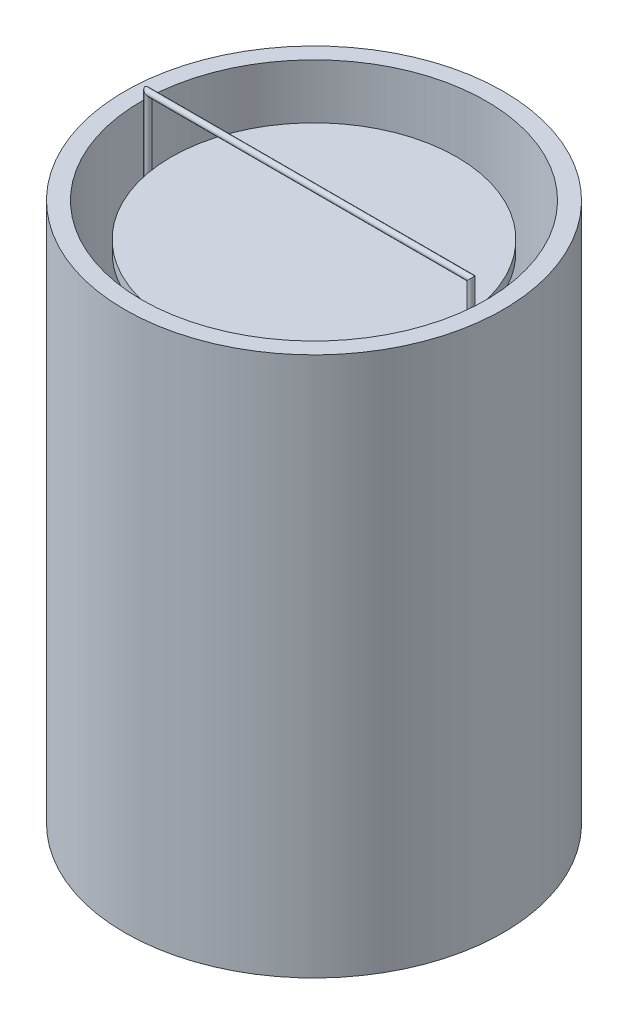
ISO-10303-21;
HEADER;
FILE_DESCRIPTION(('STEP AP214'),'2;1');
FILE_NAME('part.step','',(''),(''),'','','');
FILE_SCHEMA(('AUTOMOTIVE_DESIGN { 1 0 10303 214 1 1 1 1 }'));
ENDSEC;
DATA;
#1=APPLICATION_CONTEXT('core data for automotive mechanical design processes');
#2=APPLICATION_PROTOCOL_DEFINITION('international standard','automotive_design',2000,#1);
#3=PRODUCT_CONTEXT('',#1,'mechanical');
#4=PRODUCT('Part','Part','',(#3));
#5=PRODUCT_RELATED_PRODUCT_CATEGORY('part','',(#4));
#6=PRODUCT_DEFINITION_FORMATION('','',#4);
#7=PRODUCT_DEFINITION_CONTEXT('part definition',#1,'design');
#8=PRODUCT_DEFINITION('design','',#6,#7);
#9=PRODUCT_DEFINITION_SHAPE('','',#8);
#10=(LENGTH_UNIT() NAMED_UNIT(*) SI_UNIT(.MILLI.,.METRE.));
#11=(NAMED_UNIT(*) PLANE_ANGLE_UNIT() SI_UNIT($,.RADIAN.));
#12=(NAMED_UNIT(*) SI_UNIT($,.STERADIAN.) SOLID_ANGLE_UNIT());
#13=UNCERTAINTY_MEASURE_WITH_UNIT(LENGTH_MEASURE(1.E-05),#10,'distance_accuracy_value','');
#14=(GEOMETRIC_REPRESENTATION_CONTEXT(3) GLOBAL_UNCERTAINTY_ASSIGNED_CONTEXT((#13)) GLOBAL_UNIT_ASSIGNED_CONTEXT((#10,
#11,#12)) REPRESENTATION_CONTEXT('',''));
#15=CARTESIAN_POINT('',(0.,0.,0.));
#16=DIRECTION('',(0.,0.,1.));
#17=DIRECTION('',(1.,0.,0.));
#18=AXIS2_PLACEMENT_3D('',#15,#16,#17);
#19=CARTESIAN_POINT('',(63.5750589911287,222.175717615178,1.80350605197359));
#20=DIRECTION('',(1.,0.,0.));
#21=DIRECTION('',(0.,0.,-1.));
#22=AXIS2_PLACEMENT_3D('',#19,#20,#21);
#23=PLANE('',#22);
#24=CARTESIAN_POINT('',(63.5750589911287,222.175717615178,1.80350605197359));
#25=DIRECTION('',(1.,0.,0.));
#26=DIRECTION('',(0.,0.,-1.));
#27=AXIS2_PLACEMENT_3D('',#24,#25,#26);
#28=CIRCLE('',#27,1.325);
#29=CARTESIAN_POINT('',(63.5750589911287,222.175717615178,0.478506051973597));
#30=VERTEX_POINT('',#29);
#31=EDGE_CURVE('E49',#30,#30,#28,.T.);
#32=ORIENTED_EDGE('',*,*,#31,.F.);
#33=EDGE_LOOP('',(#32));
#34=FACE_BOUND('',#33,.T.);
#35=ADVANCED_FACE('F46',(#34),#23,.F.);
#36=CARTESIAN_POINT('',(-63.4743835410829,167.301815481761,1.80350605197474));
#37=DIRECTION('',(1.,0.,0.));
#38=DIRECTION('',(0.,0.,-1.));
#39=AXIS2_PLACEMENT_3D('',#36,#37,#38);
#40=PLANE('',#39);
#41=CARTESIAN_POINT('',(-63.4743835410829,167.301815481761,1.80350605197474));
#42=DIRECTION('',(1.,0.,0.));
#43=DIRECTION('',(0.,0.,-1.));
#44=AXIS2_PLACEMENT_3D('',#41,#42,#43);
#45=CIRCLE('',#44,1.325);
#46=CARTESIAN_POINT('',(-63.4743835410829,167.301815481761,0.478506051974744));
#47=VERTEX_POINT('',#46);
#48=EDGE_CURVE('E53',#47,#47,#45,.T.);
#49=ORIENTED_EDGE('',*,*,#48,.T.);
#50=EDGE_LOOP('',(#49));
#51=FACE_BOUND('',#50,.T.);
#52=ADVANCED_FACE('F75',(#51),#40,.T.);
#53=CARTESIAN_POINT('',(74.6570026492969,222.175717615178,1.80350605197352));
#54=DIRECTION('',(-1.,0.,0.));
#55=DIRECTION('',(0.,0.,1.));
#56=AXIS2_PLACEMENT_3D('',#53,#54,#55);
#57=CYLINDRICAL_SURFACE('',#56,1.325);
#58=CARTESIAN_POINT('',(71.6420026492969,222.175717615178,1.80350605197448));
#59=DIRECTION('',(-0.707106781186547,-0.707106781186547,0.));
#60=DIRECTION('',(0.707106781186548,-0.707106781186548,0.));
#61=AXIS2_PLACEMENT_3D('',#58,#59,#60);
#62=ELLIPSE('',#61,1.87383297014434,1.325);
#63=CARTESIAN_POINT('',(72.9670026492969,220.850717615178,1.80350605197447));
#64=VERTEX_POINT('',#63);
#65=EDGE_CURVE('E65',#64,#64,#62,.T.);
#66=ORIENTED_EDGE('',*,*,#65,.T.);
#67=EDGE_LOOP('',(#66));
#68=FACE_BOUND('',#67,.T.);
#69=ORIENTED_EDGE('',*,*,#31,.T.);
#70=EDGE_LOOP('',(#69));
#71=FACE_BOUND('',#70,.T.);
#72=ADVANCED_FACE('F72',(#68,#71),#57,.T.);
#73=CARTESIAN_POINT('',(71.6420026492969,249.764743448999,1.80350605197442));
#74=DIRECTION('',(0.,-1.,0.));
#75=DIRECTION('',(0.,0.,-1.));
#76=AXIS2_PLACEMENT_3D('',#73,#74,#75);
#77=CYLINDRICAL_SURFACE('',#76,1.325);
#78=CARTESIAN_POINT('',(71.6420026492968,246.749743448999,1.80350605197443));
#79=DIRECTION('',(0.707106781186547,-0.707106781186547,0.));
#80=DIRECTION('',(0.707106781186548,0.707106781186548,0.));
#81=AXIS2_PLACEMENT_3D('',#78,#79,#80);
#82=ELLIPSE('',#81,1.87383297014435,1.325);
#83=CARTESIAN_POINT('',(72.9670026492968,248.074743448999,1.80350605197442));
#84=VERTEX_POINT('',#83);
#85=EDGE_CURVE('E63',#84,#84,#82,.T.);
#86=ORIENTED_EDGE('',*,*,#85,.T.);
#87=EDGE_LOOP('',(#86));
#88=FACE_BOUND('',#87,.T.);
#89=ORIENTED_EDGE('',*,*,#65,.F.);
#90=EDGE_LOOP('',(#89));
#91=FACE_BOUND('',#90,.T.);
#92=ADVANCED_FACE('F95',(#88,#91),#77,.T.);
#93=CARTESIAN_POINT('',(-75.0603045278118,246.749743448999,1.80350605197455));
#94=DIRECTION('',(1.,0.,0.));
#95=DIRECTION('',(0.,0.,-1.));
#96=AXIS2_PLACEMENT_3D('',#93,#94,#95);
#97=CYLINDRICAL_SURFACE('',#96,1.325);
#98=CARTESIAN_POINT('',(-72.0453045278119,246.749743449,1.80350605197455));
#99=DIRECTION('',(0.707106781186547,0.707106781186547,0.));
#100=DIRECTION('',(-0.707106781186548,0.707106781186548,0.));
#101=AXIS2_PLACEMENT_3D('',#98,#99,#100);
#102=ELLIPSE('',#101,1.87383297014434,1.325);
#103=CARTESIAN_POINT('',(-73.3703045278119,248.074743449,1.80350605197455));
#104=VERTEX_POINT('',#103);
#105=EDGE_CURVE('E58',#104,#104,#102,.T.);
#106=ORIENTED_EDGE('',*,*,#105,.T.);
#107=EDGE_LOOP('',(#106));
#108=FACE_BOUND('',#107,.T.);
#109=ORIENTED_EDGE('',*,*,#85,.F.);
#110=EDGE_LOOP('',(#109));
#111=FACE_BOUND('',#110,.T.);
#112=ADVANCED_FACE('F88',(#108,#111),#97,.T.);
#113=CARTESIAN_POINT('',(-72.0453045278119,164.286815481761,1.80350605197469));
#114=DIRECTION('',(0.,1.,0.));
#115=DIRECTION('',(0.,0.,1.));
#116=AXIS2_PLACEMENT_3D('',#113,#114,#115);
#117=CYLINDRICAL_SURFACE('',#116,1.325);
#118=CARTESIAN_POINT('',(-72.0453045278119,167.301815481761,1.80350605197468));
#119=DIRECTION('',(-0.707106781186547,0.707106781186547,0.));
#120=DIRECTION('',(-0.707106781186548,-0.707106781186548,0.));
#121=AXIS2_PLACEMENT_3D('',#118,#119,#120);
#122=ELLIPSE('',#121,1.87383297014434,1.325);
#123=CARTESIAN_POINT('',(-73.3703045278119,165.976815481761,1.80350605197468));
#124=VERTEX_POINT('',#123);
#125=EDGE_CURVE('E11',#124,#124,#122,.T.);
#126=ORIENTED_EDGE('',*,*,#125,.T.);
#127=EDGE_LOOP('',(#126));
#128=FACE_BOUND('',#127,.T.);
#129=ORIENTED_EDGE('',*,*,#105,.F.);
#130=EDGE_LOOP('',(#129));
#131=FACE_BOUND('',#130,.T.);
#132=ADVANCED_FACE('F82',(#128,#131),#117,.T.);
#133=CARTESIAN_POINT('',(-63.4743835410829,167.301815481761,1.80350605197474));
#134=DIRECTION('',(-1.,0.,0.));
#135=DIRECTION('',(0.,0.,1.));
#136=AXIS2_PLACEMENT_3D('',#133,#134,#135);
#137=CYLINDRICAL_SURFACE('',#136,1.325);
#138=ORIENTED_EDGE('',*,*,#48,.F.);
#139=EDGE_LOOP('',(#138));
#140=FACE_BOUND('',#139,.T.);
#141=ORIENTED_EDGE('',*,*,#125,.F.);
#142=EDGE_LOOP('',(#141));
#143=FACE_BOUND('',#142,.T.);
#144=ADVANCED_FACE('F80',(#140,#143),#137,.T.);
#145=CLOSED_SHELL('',(#35,#52,#72,#92,#112,#132,#144));
#146=MANIFOLD_SOLID_BREP('B2',#145);
#147=CARTESIAN_POINT('',(0.,225.,0.));
#148=DIRECTION('',(0.,-1.,0.));
#149=DIRECTION('',(0.,0.,-1.));
#150=AXIS2_PLACEMENT_3D('',#147,#148,#149);
#151=CYLINDRICAL_SURFACE('',#150,63.5);
#152=CARTESIAN_POINT('',(0.,225.,0.));
#153=DIRECTION('',(0.,-1.,0.));
#154=DIRECTION('',(0.,0.,-1.));
#155=AXIS2_PLACEMENT_3D('',#152,#153,#154);
#156=CIRCLE('',#155,63.5);
#157=CARTESIAN_POINT('',(0.,225.,-63.5));
#158=VERTEX_POINT('',#157);
#159=EDGE_CURVE('E45',#158,#158,#156,.T.);
#160=ORIENTED_EDGE('',*,*,#159,.T.);
#161=EDGE_LOOP('',(#160));
#162=FACE_BOUND('',#161,.T.);
#163=CARTESIAN_POINT('',(0.,220.,0.));
#164=DIRECTION('',(0.,-1.,0.));
#165=DIRECTION('',(0.,0.,-1.));
#166=AXIS2_PLACEMENT_3D('',#163,#164,#165);
#167=CIRCLE('',#166,63.5);
#168=CARTESIAN_POINT('',(0.,220.,-63.5));
#169=VERTEX_POINT('',#168);
#170=EDGE_CURVE('E158',#169,#169,#167,.T.);
#171=ORIENTED_EDGE('',*,*,#170,.F.);
#172=EDGE_LOOP('',(#171));
#173=FACE_BOUND('',#172,.T.);
#174=ADVANCED_FACE('F155',(#162,#173),#151,.T.);
#175=CARTESIAN_POINT('',(0.,225.,0.));
#176=DIRECTION('',(0.,-1.,0.));
#177=DIRECTION('',(0.,0.,-1.));
#178=AXIS2_PLACEMENT_3D('',#175,#176,#177);
#179=PLANE('',#178);
#180=ORIENTED_EDGE('',*,*,#159,.F.);
#181=EDGE_LOOP('',(#180));
#182=FACE_BOUND('',#181,.T.);
#183=ADVANCED_FACE('F170',(#182),#179,.F.);
#184=CARTESIAN_POINT('',(0.,220.,0.));
#185=DIRECTION('',(0.,-1.,0.));
#186=DIRECTION('',(0.,0.,-1.));
#187=AXIS2_PLACEMENT_3D('',#184,#185,#186);
#188=PLANE('',#187);
#189=ORIENTED_EDGE('',*,*,#170,.T.);
#190=EDGE_LOOP('',(#189));
#191=FACE_BOUND('',#190,.T.);
#192=ADVANCED_FACE('F167',(#191),#188,.T.);
#193=CLOSED_SHELL('',(#174,#183,#192));
#194=MANIFOLD_SOLID_BREP('B6',#193);
#195=CARTESIAN_POINT('',(0.,170.,0.));
#196=DIRECTION('',(0.,-1.,0.));
#197=DIRECTION('',(0.,0.,-1.));
#198=AXIS2_PLACEMENT_3D('',#195,#196,#197);
#199=CYLINDRICAL_SURFACE('',#198,63.5);
#200=CARTESIAN_POINT('',(0.,170.,0.));
#201=DIRECTION('',(0.,-1.,0.));
#202=DIRECTION('',(0.,0.,-1.));
#203=AXIS2_PLACEMENT_3D('',#200,#201,#202);
#204=CIRCLE('',#203,63.5);
#205=CARTESIAN_POINT('',(0.,170.,-63.5));
#206=VERTEX_POINT('',#205);
#207=EDGE_CURVE('E154',#206,#206,#204,.T.);
#208=ORIENTED_EDGE('',*,*,#207,.T.);
#209=EDGE_LOOP('',(#208));
#210=FACE_BOUND('',#209,.T.);
#211=CARTESIAN_POINT('',(0.,165.,0.));
#212=DIRECTION('',(0.,-1.,0.));
#213=DIRECTION('',(0.,0.,-1.));
#214=AXIS2_PLACEMENT_3D('',#211,#212,#213);
#215=CIRCLE('',#214,63.5);
#216=CARTESIAN_POINT('',(0.,165.,-63.5));
#217=VERTEX_POINT('',#216);
#218=EDGE_CURVE('E207',#217,#217,#215,.T.);
#219=ORIENTED_EDGE('',*,*,#218,.F.);
#220=EDGE_LOOP('',(#219));
#221=FACE_BOUND('',#220,.T.);
#222=ADVANCED_FACE('F204',(#210,#221),#199,.T.);
#223=CARTESIAN_POINT('',(0.,170.,0.));
#224=DIRECTION('',(0.,-1.,0.));
#225=DIRECTION('',(0.,0.,-1.));
#226=AXIS2_PLACEMENT_3D('',#223,#224,#225);
#227=PLANE('',#226);
#228=ORIENTED_EDGE('',*,*,#207,.F.);
#229=EDGE_LOOP('',(#228));
#230=FACE_BOUND('',#229,.T.);
#231=ADVANCED_FACE('F219',(#230),#227,.F.);
#232=CARTESIAN_POINT('',(0.,165.,0.));
#233=DIRECTION('',(0.,-1.,0.));
#234=DIRECTION('',(0.,0.,-1.));
#235=AXIS2_PLACEMENT_3D('',#232,#233,#234);
#236=PLANE('',#235);
#237=ORIENTED_EDGE('',*,*,#218,.T.);
#238=EDGE_LOOP('',(#237));
#239=FACE_BOUND('',#238,.T.);
#240=ADVANCED_FACE('F216',(#239),#236,.T.);
#241=CLOSED_SHELL('',(#222,#231,#240));
#242=MANIFOLD_SOLID_BREP('B40',#241);
#243=CARTESIAN_POINT('',(0.,20.,0.));
#244=DIRECTION('',(0.,-1.,0.));
#245=DIRECTION('',(0.,0.,-1.));
#246=AXIS2_PLACEMENT_3D('',#243,#244,#245);
#247=CYLINDRICAL_SURFACE('',#246,76.5937);
#248=CARTESIAN_POINT('',(0.,20.,0.));
#249=DIRECTION('',(0.,-1.,0.));
#250=DIRECTION('',(0.,0.,-1.));
#251=AXIS2_PLACEMENT_3D('',#248,#249,#250);
#252=CIRCLE('',#251,76.5937);
#253=CARTESIAN_POINT('',(0.,20.,-76.5937));
#254=VERTEX_POINT('',#253);
#255=EDGE_CURVE('E203',#254,#254,#252,.T.);
#256=ORIENTED_EDGE('',*,*,#255,.T.);
#257=EDGE_LOOP('',(#256));
#258=FACE_BOUND('',#257,.T.);
#259=CARTESIAN_POINT('',(0.,0.,0.));
#260=DIRECTION('',(0.,-1.,0.));
#261=DIRECTION('',(0.,0.,-1.));
#262=AXIS2_PLACEMENT_3D('',#259,#260,#261);
#263=CIRCLE('',#262,76.5937);
#264=CARTESIAN_POINT('',(0.,0.,-76.5937));
#265=VERTEX_POINT('',#264);
#266=EDGE_CURVE('E255',#265,#265,#263,.T.);
#267=ORIENTED_EDGE('',*,*,#266,.F.);
#268=EDGE_LOOP('',(#267));
#269=FACE_BOUND('',#268,.T.);
#270=ADVANCED_FACE('F252',(#258,#269),#247,.T.);
#271=CARTESIAN_POINT('',(0.,20.,0.));
#272=DIRECTION('',(0.,-1.,0.));
#273=DIRECTION('',(0.,0.,-1.));
#274=AXIS2_PLACEMENT_3D('',#271,#272,#273);
#275=PLANE('',#274);
#276=ORIENTED_EDGE('',*,*,#255,.F.);
#277=EDGE_LOOP('',(#276));
#278=FACE_BOUND('',#277,.T.);
#279=ADVANCED_FACE('F267',(#278),#275,.F.);
#280=CARTESIAN_POINT('',(0.,0.,0.));
#281=DIRECTION('',(0.,-1.,0.));
#282=DIRECTION('',(0.,0.,-1.));
#283=AXIS2_PLACEMENT_3D('',#280,#281,#282);
#284=PLANE('',#283);
#285=ORIENTED_EDGE('',*,*,#266,.T.);
#286=EDGE_LOOP('',(#285));
#287=FACE_BOUND('',#286,.T.);
#288=ADVANCED_FACE('F264',(#287),#284,.T.);
#289=CLOSED_SHELL('',(#270,#279,#288));
#290=MANIFOLD_SOLID_BREP('B149',#289);
#291=CARTESIAN_POINT('',(0.,240.,0.));
#292=DIRECTION('',(0.,1.,0.));
#293=DIRECTION('',(0.,0.,1.));
#294=AXIS2_PLACEMENT_3D('',#291,#292,#293);
#295=PLANE('',#294);
#296=CARTESIAN_POINT('',(0.,240.,0.));
#297=DIRECTION('',(0.,1.,0.));
#298=DIRECTION('',(0.,0.,1.));
#299=AXIS2_PLACEMENT_3D('',#296,#297,#298);
#300=CIRCLE('',#299,84.1375);
#301=CARTESIAN_POINT('',(0.,240.,84.1375));
#302=VERTEX_POINT('',#301);
#303=EDGE_CURVE('E251',#302,#302,#300,.T.);
#304=ORIENTED_EDGE('',*,*,#303,.T.);
#305=EDGE_LOOP('',(#304));
#306=FACE_BOUND('',#305,.T.);
#307=CARTESIAN_POINT('',(0.,240.,0.));
#308=DIRECTION('',(0.,1.,0.));
#309=DIRECTION('',(0.,0.,1.));
#310=AXIS2_PLACEMENT_3D('',#307,#308,#309);
#311=CIRCLE('',#310,76.5937);
#312=CARTESIAN_POINT('',(0.,240.,76.5937));
#313=VERTEX_POINT('',#312);
#314=EDGE_CURVE('E304',#313,#313,#311,.T.);
#315=ORIENTED_EDGE('',*,*,#314,.F.);
#316=EDGE_LOOP('',(#315));
#317=FACE_BOUND('',#316,.T.);
#318=ADVANCED_FACE('F293',(#306,#317),#295,.T.);
#319=CARTESIAN_POINT('',(0.,0.,0.));
#320=DIRECTION('',(0.,1.,0.));
#321=DIRECTION('',(0.,0.,1.));
#322=AXIS2_PLACEMENT_3D('',#319,#320,#321);
#323=PLANE('',#322);
#324=CARTESIAN_POINT('',(0.,0.,0.));
#325=DIRECTION('',(0.,1.,0.));
#326=DIRECTION('',(0.,0.,1.));
#327=AXIS2_PLACEMENT_3D('',#324,#325,#326);
#328=CIRCLE('',#327,84.1375);
#329=CARTESIAN_POINT('',(0.,0.,84.1375));
#330=VERTEX_POINT('',#329);
#331=EDGE_CURVE('E297',#330,#330,#328,.T.);
#332=ORIENTED_EDGE('',*,*,#331,.F.);
#333=EDGE_LOOP('',(#332));
#334=FACE_BOUND('',#333,.T.);
#335=CARTESIAN_POINT('',(0.,0.,0.));
#336=DIRECTION('',(0.,1.,0.));
#337=DIRECTION('',(0.,0.,1.));
#338=AXIS2_PLACEMENT_3D('',#335,#336,#337);
#339=CIRCLE('',#338,76.5937);
#340=CARTESIAN_POINT('',(0.,0.,76.5937));
#341=VERTEX_POINT('',#340);
#342=EDGE_CURVE('E306',#341,#341,#339,.T.);
#343=ORIENTED_EDGE('',*,*,#342,.T.);
#344=EDGE_LOOP('',(#343));
#345=FACE_BOUND('',#344,.T.);
#346=ADVANCED_FACE('F316',(#334,#345),#323,.F.);
#347=CARTESIAN_POINT('',(0.,240.,0.));
#348=DIRECTION('',(0.,-1.,0.));
#349=DIRECTION('',(0.,0.,-1.));
#350=AXIS2_PLACEMENT_3D('',#347,#348,#349);
#351=CYLINDRICAL_SURFACE('',#350,84.1375);
#352=ORIENTED_EDGE('',*,*,#303,.F.);
#353=EDGE_LOOP('',(#352));
#354=FACE_BOUND('',#353,.T.);
#355=ORIENTED_EDGE('',*,*,#331,.T.);
#356=EDGE_LOOP('',(#355));
#357=FACE_BOUND('',#356,.T.);
#358=ADVANCED_FACE('F295',(#354,#357),#351,.T.);
#359=CARTESIAN_POINT('',(0.,240.,0.));
#360=DIRECTION('',(0.,-1.,0.));
#361=DIRECTION('',(0.,0.,-1.));
#362=AXIS2_PLACEMENT_3D('',#359,#360,#361);
#363=CYLINDRICAL_SURFACE('',#362,76.5937);
#364=ORIENTED_EDGE('',*,*,#314,.T.);
#365=EDGE_LOOP('',(#364));
#366=FACE_BOUND('',#365,.T.);
#367=ORIENTED_EDGE('',*,*,#342,.F.);
#368=EDGE_LOOP('',(#367));
#369=FACE_BOUND('',#368,.T.);
#370=ADVANCED_FACE('F312',(#366,#369),#363,.F.);
#371=CLOSED_SHELL('',(#318,#346,#358,#370));
#372=MANIFOLD_SOLID_BREP('B198',#371);
#373=ADVANCED_BREP_SHAPE_REPRESENTATION('',(#18,#146,#194,#242,#290,#372),#14);
#374=SHAPE_DEFINITION_REPRESENTATION(#9,#373);
ENDSEC;
END-ISO-10303-21;
